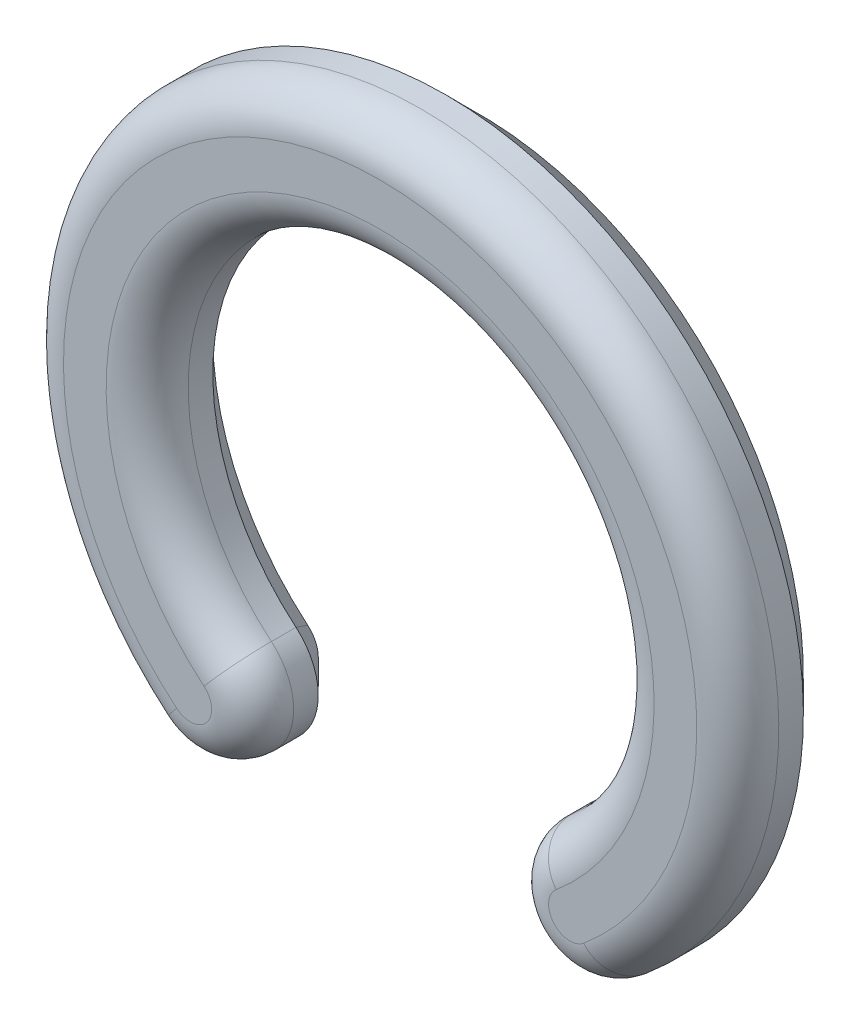
ISO-10303-21;
HEADER;
FILE_DESCRIPTION(('STEP AP214'),'2;1');
FILE_NAME('part.step','',(''),(''),'','','');
FILE_SCHEMA(('AUTOMOTIVE_DESIGN { 1 0 10303 214 1 1 1 1 }'));
ENDSEC;
DATA;
#1=APPLICATION_CONTEXT('core data for automotive mechanical design processes');
#2=APPLICATION_PROTOCOL_DEFINITION('international standard','automotive_design',2000,#1);
#3=PRODUCT_CONTEXT('',#1,'mechanical');
#4=PRODUCT('Part','Part','',(#3));
#5=PRODUCT_RELATED_PRODUCT_CATEGORY('part','',(#4));
#6=PRODUCT_DEFINITION_FORMATION('','',#4);
#7=PRODUCT_DEFINITION_CONTEXT('part definition',#1,'design');
#8=PRODUCT_DEFINITION('design','',#6,#7);
#9=PRODUCT_DEFINITION_SHAPE('','',#8);
#10=(LENGTH_UNIT() NAMED_UNIT(*) SI_UNIT(.MILLI.,.METRE.));
#11=(NAMED_UNIT(*) PLANE_ANGLE_UNIT() SI_UNIT($,.RADIAN.));
#12=(NAMED_UNIT(*) SI_UNIT($,.STERADIAN.) SOLID_ANGLE_UNIT());
#13=UNCERTAINTY_MEASURE_WITH_UNIT(LENGTH_MEASURE(1.E-05),#10,'distance_accuracy_value','');
#14=(GEOMETRIC_REPRESENTATION_CONTEXT(3) GLOBAL_UNCERTAINTY_ASSIGNED_CONTEXT((#13)) GLOBAL_UNIT_ASSIGNED_CONTEXT((#10,
#11,#12)) REPRESENTATION_CONTEXT('',''));
#15=CARTESIAN_POINT('',(0.,0.,0.));
#16=DIRECTION('',(0.,0.,1.));
#17=DIRECTION('',(1.,0.,0.));
#18=AXIS2_PLACEMENT_3D('',#15,#16,#17);
#19=CARTESIAN_POINT('',(-5.78508848717886,-6.89439998807079,3.));
#20=DIRECTION('',(0.,0.,-1.));
#21=DIRECTION('',(-1.,0.,0.));
#22=AXIS2_PLACEMENT_3D('',#19,#20,#21);
#23=CYLINDRICAL_SURFACE('',#22,1.9);
#24=DIRECTION('',(0.,0.,-1.));
#25=VECTOR('',#24,1.);
#26=CARTESIAN_POINT('',(-4.56379202877443,-5.43891554614474,3.));
#27=LINE('',#26,#25);
#28=CARTESIAN_POINT('',(-4.56379202877443,-5.43891554614474,1.75));
#29=VERTEX_POINT('',#28);
#30=CARTESIAN_POINT('',(-4.56379202877443,-5.43891554614474,1.));
#31=VERTEX_POINT('',#30);
#32=EDGE_CURVE('E108',#29,#31,#27,.T.);
#33=ORIENTED_EDGE('',*,*,#32,.F.);
#34=CARTESIAN_POINT('',(-5.78508848717886,-6.89439998807079,1.75));
#35=DIRECTION('',(0.,0.,1.));
#36=DIRECTION('',(1.,0.,0.));
#37=AXIS2_PLACEMENT_3D('',#34,#35,#36);
#38=CIRCLE('',#37,1.9);
#39=CARTESIAN_POINT('',(-7.00638494558329,-8.34988442999685,1.75));
#40=VERTEX_POINT('',#39);
#41=EDGE_CURVE('E162',#29,#40,#38,.F.);
#42=ORIENTED_EDGE('',*,*,#41,.T.);
#43=DIRECTION('',(0.,0.,-1.));
#44=VECTOR('',#43,1.);
#45=CARTESIAN_POINT('',(-7.00638494558329,-8.34988442999685,3.));
#46=LINE('',#45,#44);
#47=CARTESIAN_POINT('',(-7.00638494558329,-8.34988442999685,1.));
#48=VERTEX_POINT('',#47);
#49=EDGE_CURVE('E153',#40,#48,#46,.T.);
#50=ORIENTED_EDGE('',*,*,#49,.T.);
#51=CARTESIAN_POINT('',(-5.78508848717886,-6.89439998807079,1.));
#52=DIRECTION('',(0.,0.,1.));
#53=DIRECTION('',(1.,0.,0.));
#54=AXIS2_PLACEMENT_3D('',#51,#52,#53);
#55=CIRCLE('',#54,1.9);
#56=EDGE_CURVE('E128',#48,#31,#55,.T.);
#57=ORIENTED_EDGE('',*,*,#56,.T.);
#58=EDGE_LOOP('',(#33,#42,#50,#57));
#59=FACE_BOUND('',#58,.T.);
#60=ADVANCED_FACE('F35',(#59),#23,.T.);
#61=CARTESIAN_POINT('',(0.,0.,3.));
#62=DIRECTION('',(0.,0.,-1.));
#63=DIRECTION('',(-1.,0.,0.));
#64=AXIS2_PLACEMENT_3D('',#61,#62,#63);
#65=CYLINDRICAL_SURFACE('',#64,7.1);
#66=DIRECTION('',(0.,0.,-1.));
#67=VECTOR('',#66,1.);
#68=CARTESIAN_POINT('',(4.56379202877444,-5.43891554614474,3.));
#69=LINE('',#68,#67);
#70=CARTESIAN_POINT('',(4.56379202877444,-5.43891554614474,1.75));
#71=VERTEX_POINT('',#70);
#72=CARTESIAN_POINT('',(4.56379202877444,-5.43891554614474,1.));
#73=VERTEX_POINT('',#72);
#74=EDGE_CURVE('E99',#71,#73,#69,.T.);
#75=ORIENTED_EDGE('',*,*,#74,.F.);
#76=CARTESIAN_POINT('',(0.,0.,1.75));
#77=DIRECTION('',(0.,0.,1.));
#78=DIRECTION('',(1.,0.,0.));
#79=AXIS2_PLACEMENT_3D('',#76,#77,#78);
#80=CIRCLE('',#79,7.1);
#81=EDGE_CURVE('E11',#71,#29,#80,.T.);
#82=ORIENTED_EDGE('',*,*,#81,.T.);
#83=ORIENTED_EDGE('',*,*,#32,.T.);
#84=CARTESIAN_POINT('',(0.,0.,1.));
#85=DIRECTION('',(0.,0.,1.));
#86=DIRECTION('',(1.,0.,0.));
#87=AXIS2_PLACEMENT_3D('',#84,#85,#86);
#88=CIRCLE('',#87,7.1);
#89=EDGE_CURVE('E117',#31,#73,#88,.F.);
#90=ORIENTED_EDGE('',*,*,#89,.T.);
#91=EDGE_LOOP('',(#75,#82,#83,#90));
#92=FACE_BOUND('',#91,.T.);
#93=ADVANCED_FACE('F130',(#92),#65,.F.);
#94=CARTESIAN_POINT('',(5.78508848717886,-6.89439998807079,3.));
#95=DIRECTION('',(0.,0.,-1.));
#96=DIRECTION('',(-1.,0.,0.));
#97=AXIS2_PLACEMENT_3D('',#94,#95,#96);
#98=CYLINDRICAL_SURFACE('',#97,1.9);
#99=DIRECTION('',(0.,0.,-1.));
#100=VECTOR('',#99,1.);
#101=CARTESIAN_POINT('',(7.00638494558329,-8.34988442999685,3.));
#102=LINE('',#101,#100);
#103=CARTESIAN_POINT('',(7.00638494558329,-8.34988442999685,1.75));
#104=VERTEX_POINT('',#103);
#105=CARTESIAN_POINT('',(7.00638494558329,-8.34988442999685,1.));
#106=VERTEX_POINT('',#105);
#107=EDGE_CURVE('E109',#104,#106,#102,.T.);
#108=ORIENTED_EDGE('',*,*,#107,.F.);
#109=CARTESIAN_POINT('',(5.78508848717886,-6.89439998807079,1.75));
#110=DIRECTION('',(0.,0.,1.));
#111=DIRECTION('',(1.,0.,0.));
#112=AXIS2_PLACEMENT_3D('',#109,#110,#111);
#113=CIRCLE('',#112,1.9);
#114=EDGE_CURVE('E44',#104,#71,#113,.F.);
#115=ORIENTED_EDGE('',*,*,#114,.T.);
#116=ORIENTED_EDGE('',*,*,#74,.T.);
#117=CARTESIAN_POINT('',(5.78508848717886,-6.89439998807079,1.));
#118=DIRECTION('',(0.,0.,1.));
#119=DIRECTION('',(1.,0.,0.));
#120=AXIS2_PLACEMENT_3D('',#117,#118,#119);
#121=CIRCLE('',#120,1.9);
#122=EDGE_CURVE('E103',#73,#106,#121,.T.);
#123=ORIENTED_EDGE('',*,*,#122,.T.);
#124=EDGE_LOOP('',(#108,#115,#116,#123));
#125=FACE_BOUND('',#124,.T.);
#126=ADVANCED_FACE('F101',(#125),#98,.T.);
#127=CARTESIAN_POINT('',(0.,0.,3.));
#128=DIRECTION('',(0.,0.,-1.));
#129=DIRECTION('',(-1.,0.,0.));
#130=AXIS2_PLACEMENT_3D('',#127,#128,#129);
#131=CYLINDRICAL_SURFACE('',#130,10.9);
#132=ORIENTED_EDGE('',*,*,#49,.F.);
#133=CARTESIAN_POINT('',(0.,0.,1.75));
#134=DIRECTION('',(0.,0.,1.));
#135=DIRECTION('',(1.,0.,0.));
#136=AXIS2_PLACEMENT_3D('',#133,#134,#135);
#137=CIRCLE('',#136,10.9);
#138=EDGE_CURVE('E59',#40,#104,#137,.F.);
#139=ORIENTED_EDGE('',*,*,#138,.T.);
#140=ORIENTED_EDGE('',*,*,#107,.T.);
#141=CARTESIAN_POINT('',(0.,0.,1.));
#142=DIRECTION('',(0.,0.,1.));
#143=DIRECTION('',(1.,0.,0.));
#144=AXIS2_PLACEMENT_3D('',#141,#142,#143);
#145=CIRCLE('',#144,10.9);
#146=EDGE_CURVE('E144',#106,#48,#145,.T.);
#147=ORIENTED_EDGE('',*,*,#146,.T.);
#148=EDGE_LOOP('',(#132,#139,#140,#147));
#149=FACE_BOUND('',#148,.T.);
#150=ADVANCED_FACE('F196',(#149),#131,.T.);
#151=CARTESIAN_POINT('',(-2.89254424358943,-3.4471999940354,3.));
#152=DIRECTION('',(0.,0.,1.));
#153=DIRECTION('',(1.,0.,0.));
#154=AXIS2_PLACEMENT_3D('',#151,#152,#153);
#155=PLANE('',#154);
#156=CARTESIAN_POINT('',(0.,0.,3.));
#157=DIRECTION('',(0.,0.,1.));
#158=DIRECTION('',(1.,0.,0.));
#159=AXIS2_PLACEMENT_3D('',#156,#157,#158);
#160=CIRCLE('',#159,9.65);
#161=CARTESIAN_POINT('',(6.20290043347512,-7.39232887609813,3.));
#162=VERTEX_POINT('',#161);
#163=CARTESIAN_POINT('',(-6.20290043347512,-7.39232887609813,3.));
#164=VERTEX_POINT('',#163);
#165=EDGE_CURVE('E157',#162,#164,#160,.T.);
#166=ORIENTED_EDGE('',*,*,#165,.T.);
#167=CARTESIAN_POINT('',(-5.78508848717886,-6.89439998807079,3.));
#168=DIRECTION('',(0.,0.,1.));
#169=DIRECTION('',(1.,0.,0.));
#170=AXIS2_PLACEMENT_3D('',#167,#168,#169);
#171=CIRCLE('',#170,0.65);
#172=CARTESIAN_POINT('',(-5.36727654088261,-6.39647110004346,3.));
#173=VERTEX_POINT('',#172);
#174=EDGE_CURVE('E159',#164,#173,#171,.T.);
#175=ORIENTED_EDGE('',*,*,#174,.T.);
#176=CARTESIAN_POINT('',(0.,0.,3.));
#177=DIRECTION('',(0.,0.,1.));
#178=DIRECTION('',(1.,0.,0.));
#179=AXIS2_PLACEMENT_3D('',#176,#177,#178);
#180=CIRCLE('',#179,8.35);
#181=CARTESIAN_POINT('',(5.36727654088261,-6.39647110004346,3.));
#182=VERTEX_POINT('',#181);
#183=EDGE_CURVE('E146',#173,#182,#180,.F.);
#184=ORIENTED_EDGE('',*,*,#183,.T.);
#185=CARTESIAN_POINT('',(5.78508848717886,-6.89439998807079,3.));
#186=DIRECTION('',(0.,0.,1.));
#187=DIRECTION('',(1.,0.,0.));
#188=AXIS2_PLACEMENT_3D('',#185,#186,#187);
#189=CIRCLE('',#188,0.65);
#190=EDGE_CURVE('E155',#182,#162,#189,.T.);
#191=ORIENTED_EDGE('',*,*,#190,.T.);
#192=EDGE_LOOP('',(#166,#175,#184,#191));
#193=FACE_BOUND('',#192,.T.);
#194=ADVANCED_FACE('F193',(#193),#155,.T.);
#195=CARTESIAN_POINT('',(-2.89254424358943,-3.4471999940354,0.));
#196=DIRECTION('',(0.,0.,1.));
#197=DIRECTION('',(1.,0.,0.));
#198=AXIS2_PLACEMENT_3D('',#195,#196,#197);
#199=PLANE('',#198);
#200=CARTESIAN_POINT('',(5.78508848717886,-6.89439998807079,0.));
#201=DIRECTION('',(0.,0.,1.));
#202=DIRECTION('',(1.,0.,0.));
#203=AXIS2_PLACEMENT_3D('',#200,#201,#202);
#204=CIRCLE('',#203,0.899999999999992);
#205=CARTESIAN_POINT('',(6.36359733589675,-7.58383998687787,0.));
#206=VERTEX_POINT('',#205);
#207=CARTESIAN_POINT('',(5.20657963846098,-6.20495998926372,0.));
#208=VERTEX_POINT('',#207);
#209=EDGE_CURVE('E140',#206,#208,#204,.F.);
#210=ORIENTED_EDGE('',*,*,#209,.T.);
#211=CARTESIAN_POINT('',(0.,0.,0.));
#212=DIRECTION('',(0.,0.,1.));
#213=DIRECTION('',(1.,0.,0.));
#214=AXIS2_PLACEMENT_3D('',#211,#212,#213);
#215=CIRCLE('',#214,8.10000000000001);
#216=CARTESIAN_POINT('',(-5.20657963846098,-6.20495998926372,0.));
#217=VERTEX_POINT('',#216);
#218=EDGE_CURVE('E119',#208,#217,#215,.T.);
#219=ORIENTED_EDGE('',*,*,#218,.T.);
#220=CARTESIAN_POINT('',(-5.78508848717886,-6.89439998807079,0.));
#221=DIRECTION('',(0.,0.,1.));
#222=DIRECTION('',(1.,0.,0.));
#223=AXIS2_PLACEMENT_3D('',#220,#221,#222);
#224=CIRCLE('',#223,0.899999999999992);
#225=CARTESIAN_POINT('',(-6.36359733589674,-7.58383998687787,0.));
#226=VERTEX_POINT('',#225);
#227=EDGE_CURVE('E135',#217,#226,#224,.F.);
#228=ORIENTED_EDGE('',*,*,#227,.T.);
#229=CARTESIAN_POINT('',(0.,0.,0.));
#230=DIRECTION('',(0.,0.,1.));
#231=DIRECTION('',(1.,0.,0.));
#232=AXIS2_PLACEMENT_3D('',#229,#230,#231);
#233=CIRCLE('',#232,9.89999999999999);
#234=EDGE_CURVE('E133',#226,#206,#233,.F.);
#235=ORIENTED_EDGE('',*,*,#234,.T.);
#236=EDGE_LOOP('',(#210,#219,#228,#235));
#237=FACE_BOUND('',#236,.T.);
#238=ADVANCED_FACE('F195',(#237),#199,.F.);
#239=CARTESIAN_POINT('',(0.,0.,1.));
#240=DIRECTION('',(0.,0.,1.));
#241=DIRECTION('',(1.,0.,0.));
#242=AXIS2_PLACEMENT_3D('',#239,#240,#241);
#243=CONICAL_SURFACE('',#242,10.9,0.78539816339745);
#244=DIRECTION('',(0.454519477672045,-0.541675220419702,0.707106781186546));
#245=VECTOR('',#244,1.);
#246=CARTESIAN_POINT('',(6.36359733589675,-7.58383998687787,0.));
#247=LINE('',#246,#245);
#248=EDGE_CURVE('E127',#206,#106,#247,.T.);
#249=ORIENTED_EDGE('',*,*,#248,.F.);
#250=ORIENTED_EDGE('',*,*,#234,.F.);
#251=DIRECTION('',(0.454519477672044,0.541675220419703,-0.707106781186546));
#252=VECTOR('',#251,1.);
#253=CARTESIAN_POINT('',(-7.00638494558329,-8.34988442999685,1.));
#254=LINE('',#253,#252);
#255=EDGE_CURVE('E150',#48,#226,#254,.T.);
#256=ORIENTED_EDGE('',*,*,#255,.F.);
#257=ORIENTED_EDGE('',*,*,#146,.F.);
#258=EDGE_LOOP('',(#249,#250,#256,#257));
#259=FACE_BOUND('',#258,.T.);
#260=ADVANCED_FACE('F202',(#259),#243,.T.);
#261=CARTESIAN_POINT('',(-5.78508848717886,-6.89439998807079,1.));
#262=DIRECTION('',(0.,0.,1.));
#263=DIRECTION('',(1.,0.,0.));
#264=AXIS2_PLACEMENT_3D('',#261,#262,#263);
#265=CONICAL_SURFACE('',#264,1.9,0.78539816339745);
#266=ORIENTED_EDGE('',*,*,#255,.T.);
#267=ORIENTED_EDGE('',*,*,#227,.F.);
#268=DIRECTION('',(-0.454519477672045,-0.541675220419703,-0.707106781186546));
#269=VECTOR('',#268,1.);
#270=CARTESIAN_POINT('',(-4.56379202877443,-5.43891554614474,1.));
#271=LINE('',#270,#269);
#272=EDGE_CURVE('E122',#31,#217,#271,.T.);
#273=ORIENTED_EDGE('',*,*,#272,.F.);
#274=ORIENTED_EDGE('',*,*,#56,.F.);
#275=EDGE_LOOP('',(#266,#267,#273,#274));
#276=FACE_BOUND('',#275,.T.);
#277=ADVANCED_FACE('F225',(#276),#265,.T.);
#278=CARTESIAN_POINT('',(5.78508848717886,-6.89439998807079,1.));
#279=DIRECTION('',(0.,0.,1.));
#280=DIRECTION('',(1.,0.,0.));
#281=AXIS2_PLACEMENT_3D('',#278,#279,#280);
#282=CONICAL_SURFACE('',#281,1.9,0.78539816339745);
#283=ORIENTED_EDGE('',*,*,#248,.T.);
#284=ORIENTED_EDGE('',*,*,#122,.F.);
#285=DIRECTION('',(-0.454519477672045,0.541675220419702,0.707106781186546));
#286=VECTOR('',#285,1.);
#287=CARTESIAN_POINT('',(5.20657963846098,-6.20495998926372,0.));
#288=LINE('',#287,#286);
#289=EDGE_CURVE('E115',#208,#73,#288,.T.);
#290=ORIENTED_EDGE('',*,*,#289,.F.);
#291=ORIENTED_EDGE('',*,*,#209,.F.);
#292=EDGE_LOOP('',(#283,#284,#290,#291));
#293=FACE_BOUND('',#292,.T.);
#294=ADVANCED_FACE('F125',(#293),#282,.T.);
#295=CARTESIAN_POINT('',(0.,0.,1.));
#296=DIRECTION('',(0.,0.,-1.));
#297=DIRECTION('',(-1.,0.,0.));
#298=AXIS2_PLACEMENT_3D('',#295,#296,#297);
#299=CONICAL_SURFACE('',#298,7.1,0.78539816339745);
#300=ORIENTED_EDGE('',*,*,#272,.T.);
#301=ORIENTED_EDGE('',*,*,#218,.F.);
#302=ORIENTED_EDGE('',*,*,#289,.T.);
#303=ORIENTED_EDGE('',*,*,#89,.F.);
#304=EDGE_LOOP('',(#300,#301,#302,#303));
#305=FACE_BOUND('',#304,.T.);
#306=ADVANCED_FACE('F116',(#305),#299,.F.);
#307=CARTESIAN_POINT('',(5.78508848717886,-6.89439998807079,1.75));
#308=DIRECTION('',(0.,0.,1.));
#309=DIRECTION('',(1.,0.,0.));
#310=AXIS2_PLACEMENT_3D('',#307,#308,#309);
#311=DEGENERATE_TOROIDAL_SURFACE('',#310,0.65,1.25,.T.);
#312=CARTESIAN_POINT('',(5.36727654088261,-6.39647110004346,1.75));
#313=DIRECTION('',(0.766044443118977,0.64278760968654,0.));
#314=DIRECTION('',(-0.64278760968654,0.766044443118977,0.));
#315=AXIS2_PLACEMENT_3D('',#312,#313,#314);
#316=CIRCLE('',#315,1.25);
#317=EDGE_CURVE('E170',#71,#182,#316,.T.);
#318=ORIENTED_EDGE('',*,*,#317,.F.);
#319=ORIENTED_EDGE('',*,*,#114,.F.);
#320=CARTESIAN_POINT('',(6.20290043347512,-7.39232887609813,1.75));
#321=DIRECTION('',(0.766044443118977,0.64278760968654,0.));
#322=DIRECTION('',(-0.64278760968654,0.766044443118977,0.));
#323=AXIS2_PLACEMENT_3D('',#320,#321,#322);
#324=CIRCLE('',#323,1.25);
#325=EDGE_CURVE('E39',#162,#104,#324,.T.);
#326=ORIENTED_EDGE('',*,*,#325,.F.);
#327=ORIENTED_EDGE('',*,*,#190,.F.);
#328=EDGE_LOOP('',(#318,#319,#326,#327));
#329=FACE_BOUND('',#328,.T.);
#330=ADVANCED_FACE('F37',(#329),#311,.T.);
#331=CARTESIAN_POINT('',(0.,0.,1.75));
#332=DIRECTION('',(0.,0.,1.));
#333=DIRECTION('',(1.,0.,0.));
#334=AXIS2_PLACEMENT_3D('',#331,#332,#333);
#335=TOROIDAL_SURFACE('',#334,9.65,1.25);
#336=ORIENTED_EDGE('',*,*,#325,.T.);
#337=ORIENTED_EDGE('',*,*,#138,.F.);
#338=CARTESIAN_POINT('',(-6.20290043347512,-7.39232887609813,1.75));
#339=DIRECTION('',(0.766044443118979,-0.642787609686539,0.));
#340=DIRECTION('',(0.642787609686539,0.766044443118979,0.));
#341=AXIS2_PLACEMENT_3D('',#338,#339,#340);
#342=CIRCLE('',#341,1.25);
#343=EDGE_CURVE('E169',#164,#40,#342,.T.);
#344=ORIENTED_EDGE('',*,*,#343,.F.);
#345=ORIENTED_EDGE('',*,*,#165,.F.);
#346=EDGE_LOOP('',(#336,#337,#344,#345));
#347=FACE_BOUND('',#346,.T.);
#348=ADVANCED_FACE('F179',(#347),#335,.T.);
#349=CARTESIAN_POINT('',(0.,0.,1.75));
#350=DIRECTION('',(0.,0.,1.));
#351=DIRECTION('',(1.,0.,0.));
#352=AXIS2_PLACEMENT_3D('',#349,#350,#351);
#353=TOROIDAL_SURFACE('',#352,8.35,1.25);
#354=ORIENTED_EDGE('',*,*,#317,.T.);
#355=ORIENTED_EDGE('',*,*,#183,.F.);
#356=CARTESIAN_POINT('',(-5.36727654088261,-6.39647110004346,1.75));
#357=DIRECTION('',(0.766044443118977,-0.64278760968654,0.));
#358=DIRECTION('',(0.64278760968654,0.766044443118977,0.));
#359=AXIS2_PLACEMENT_3D('',#356,#357,#358);
#360=CIRCLE('',#359,1.25);
#361=EDGE_CURVE('E167',#29,#173,#360,.T.);
#362=ORIENTED_EDGE('',*,*,#361,.F.);
#363=ORIENTED_EDGE('',*,*,#81,.F.);
#364=EDGE_LOOP('',(#354,#355,#362,#363));
#365=FACE_BOUND('',#364,.T.);
#366=ADVANCED_FACE('F184',(#365),#353,.T.);
#367=CARTESIAN_POINT('',(-5.78508848717886,-6.89439998807079,1.75));
#368=DIRECTION('',(0.,0.,1.));
#369=DIRECTION('',(1.,0.,0.));
#370=AXIS2_PLACEMENT_3D('',#367,#368,#369);
#371=DEGENERATE_TOROIDAL_SURFACE('',#370,0.65,1.25,.T.);
#372=ORIENTED_EDGE('',*,*,#343,.T.);
#373=ORIENTED_EDGE('',*,*,#41,.F.);
#374=ORIENTED_EDGE('',*,*,#361,.T.);
#375=ORIENTED_EDGE('',*,*,#174,.F.);
#376=EDGE_LOOP('',(#372,#373,#374,#375));
#377=FACE_BOUND('',#376,.T.);
#378=ADVANCED_FACE('F190',(#377),#371,.T.);
#379=CLOSED_SHELL('',(#60,#93,#126,#150,#194,#238,#260,#277,#294,#306,#330,#348,#366,#378));
#380=MANIFOLD_SOLID_BREP('B2',#379);
#381=ADVANCED_BREP_SHAPE_REPRESENTATION('',(#18,#380),#14);
#382=SHAPE_DEFINITION_REPRESENTATION(#9,#381);
ENDSEC;
END-ISO-10303-21;
